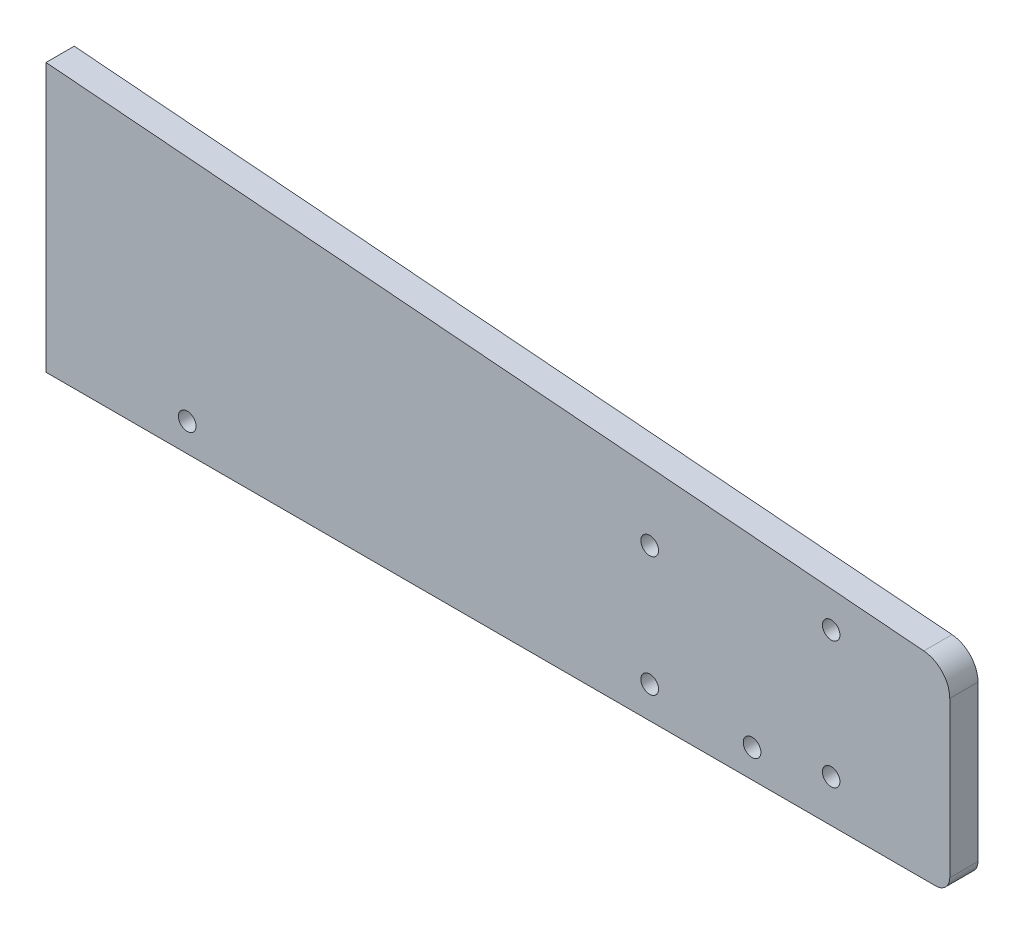
ISO-10303-21;
HEADER;
FILE_DESCRIPTION(('STEP AP214'),'2;1');
FILE_NAME('part.step','',(''),(''),'','','');
FILE_SCHEMA(('AUTOMOTIVE_DESIGN { 1 0 10303 214 1 1 1 1 }'));
ENDSEC;
DATA;
#1=APPLICATION_CONTEXT('core data for automotive mechanical design processes');
#2=APPLICATION_PROTOCOL_DEFINITION('international standard','automotive_design',2000,#1);
#3=PRODUCT_CONTEXT('',#1,'mechanical');
#4=PRODUCT('Part','Part','',(#3));
#5=PRODUCT_RELATED_PRODUCT_CATEGORY('part','',(#4));
#6=PRODUCT_DEFINITION_FORMATION('','',#4);
#7=PRODUCT_DEFINITION_CONTEXT('part definition',#1,'design');
#8=PRODUCT_DEFINITION('design','',#6,#7);
#9=PRODUCT_DEFINITION_SHAPE('','',#8);
#10=(LENGTH_UNIT() NAMED_UNIT(*) SI_UNIT(.MILLI.,.METRE.));
#11=(NAMED_UNIT(*) PLANE_ANGLE_UNIT() SI_UNIT($,.RADIAN.));
#12=(NAMED_UNIT(*) SI_UNIT($,.STERADIAN.) SOLID_ANGLE_UNIT());
#13=UNCERTAINTY_MEASURE_WITH_UNIT(LENGTH_MEASURE(1.E-05),#10,'distance_accuracy_value','');
#14=(GEOMETRIC_REPRESENTATION_CONTEXT(3) GLOBAL_UNCERTAINTY_ASSIGNED_CONTEXT((#13)) GLOBAL_UNIT_ASSIGNED_CONTEXT((#10,
#11,#12)) REPRESENTATION_CONTEXT('',''));
#15=CARTESIAN_POINT('',(0.,0.,0.));
#16=DIRECTION('',(0.,0.,1.));
#17=DIRECTION('',(1.,0.,0.));
#18=AXIS2_PLACEMENT_3D('',#15,#16,#17);
#19=CARTESIAN_POINT('',(469.9,0.,12.7));
#20=DIRECTION('',(0.,1.,0.));
#21=DIRECTION('',(-1.,0.,0.));
#22=AXIS2_PLACEMENT_3D('',#19,#20,#21);
#23=PLANE('',#22);
#24=DIRECTION('',(1.,0.,0.));
#25=VECTOR('',#24,1.);
#26=CARTESIAN_POINT('',(469.9,0.,0.));
#27=LINE('',#26,#25);
#28=CARTESIAN_POINT('',(63.5,0.,0.));
#29=VERTEX_POINT('',#28);
#30=CARTESIAN_POINT('',(463.55,0.,0.));
#31=VERTEX_POINT('',#30);
#32=EDGE_CURVE('E117',#29,#31,#27,.T.);
#33=ORIENTED_EDGE('',*,*,#32,.T.);
#34=DIRECTION('',(0.,0.,-1.));
#35=VECTOR('',#34,1.);
#36=CARTESIAN_POINT('',(463.55,0.,12.7));
#37=LINE('',#36,#35);
#38=CARTESIAN_POINT('',(463.55,0.,12.7));
#39=VERTEX_POINT('',#38);
#40=EDGE_CURVE('E41',#31,#39,#37,.F.);
#41=ORIENTED_EDGE('',*,*,#40,.T.);
#42=DIRECTION('',(1.,0.,0.));
#43=VECTOR('',#42,1.);
#44=CARTESIAN_POINT('',(469.9,0.,12.7));
#45=LINE('',#44,#43);
#46=CARTESIAN_POINT('',(63.5,0.,12.7));
#47=VERTEX_POINT('',#46);
#48=EDGE_CURVE('E95',#47,#39,#45,.T.);
#49=ORIENTED_EDGE('',*,*,#48,.F.);
#50=DIRECTION('',(0.,0.,-1.));
#51=VECTOR('',#50,1.);
#52=CARTESIAN_POINT('',(63.5,0.,12.7));
#53=LINE('',#52,#51);
#54=EDGE_CURVE('E116',#47,#29,#53,.T.);
#55=ORIENTED_EDGE('',*,*,#54,.T.);
#56=EDGE_LOOP('',(#33,#41,#49,#55));
#57=FACE_BOUND('',#56,.T.);
#58=ADVANCED_FACE('F33',(#57),#23,.F.);
#59=CARTESIAN_POINT('',(469.9,76.2,12.7));
#60=DIRECTION('',(-1.,0.,0.));
#61=DIRECTION('',(0.,0.,1.));
#62=AXIS2_PLACEMENT_3D('',#59,#60,#61);
#63=PLANE('',#62);
#64=DIRECTION('',(0.,1.,0.));
#65=VECTOR('',#64,1.);
#66=CARTESIAN_POINT('',(469.9,76.2,12.7));
#67=LINE('',#66,#65);
#68=CARTESIAN_POINT('',(469.9,6.34999999999999,12.7));
#69=VERTEX_POINT('',#68);
#70=CARTESIAN_POINT('',(469.9,76.2,12.7));
#71=VERTEX_POINT('',#70);
#72=EDGE_CURVE('E85',#69,#71,#67,.T.);
#73=ORIENTED_EDGE('',*,*,#72,.F.);
#74=DIRECTION('',(0.,0.,-1.));
#75=VECTOR('',#74,1.);
#76=CARTESIAN_POINT('',(469.9,6.34999999999999,12.7));
#77=LINE('',#76,#75);
#78=CARTESIAN_POINT('',(469.9,6.34999999999999,0.));
#79=VERTEX_POINT('',#78);
#80=EDGE_CURVE('E103',#69,#79,#77,.T.);
#81=ORIENTED_EDGE('',*,*,#80,.T.);
#82=DIRECTION('',(0.,1.,0.));
#83=VECTOR('',#82,1.);
#84=CARTESIAN_POINT('',(469.9,76.2,0.));
#85=LINE('',#84,#83);
#86=CARTESIAN_POINT('',(469.9,76.2,0.));
#87=VERTEX_POINT('',#86);
#88=EDGE_CURVE('E100',#79,#87,#85,.T.);
#89=ORIENTED_EDGE('',*,*,#88,.T.);
#90=DIRECTION('',(0.,0.,-1.));
#91=VECTOR('',#90,1.);
#92=CARTESIAN_POINT('',(469.9,76.2,12.7));
#93=LINE('',#92,#91);
#94=EDGE_CURVE('E98',#71,#87,#93,.T.);
#95=ORIENTED_EDGE('',*,*,#94,.F.);
#96=EDGE_LOOP('',(#73,#81,#89,#95));
#97=FACE_BOUND('',#96,.T.);
#98=ADVANCED_FACE('F99',(#97),#63,.F.);
#99=CARTESIAN_POINT('',(457.2,76.2,12.7));
#100=DIRECTION('',(0.,0.,-1.));
#101=DIRECTION('',(-1.,0.,0.));
#102=AXIS2_PLACEMENT_3D('',#99,#100,#101);
#103=CYLINDRICAL_SURFACE('',#102,12.7);
#104=CARTESIAN_POINT('',(457.2,76.2,0.));
#105=DIRECTION('',(0.,0.,1.));
#106=DIRECTION('',(1.,0.,0.));
#107=AXIS2_PLACEMENT_3D('',#104,#105,#106);
#108=CIRCLE('',#107,12.7);
#109=CARTESIAN_POINT('',(458.21956543178,88.8590081100503,0.));
#110=VERTEX_POINT('',#109);
#111=EDGE_CURVE('E121',#87,#110,#108,.T.);
#112=ORIENTED_EDGE('',*,*,#111,.T.);
#113=DIRECTION('',(0.,0.,-1.));
#114=VECTOR('',#113,1.);
#115=CARTESIAN_POINT('',(458.21956543178,88.8590081100503,12.7));
#116=LINE('',#115,#114);
#117=CARTESIAN_POINT('',(458.21956543178,88.8590081100503,12.7));
#118=VERTEX_POINT('',#117);
#119=EDGE_CURVE('E104',#118,#110,#116,.T.);
#120=ORIENTED_EDGE('',*,*,#119,.F.);
#121=CARTESIAN_POINT('',(457.2,76.2,12.7));
#122=DIRECTION('',(0.,0.,1.));
#123=DIRECTION('',(1.,0.,0.));
#124=AXIS2_PLACEMENT_3D('',#121,#122,#123);
#125=CIRCLE('',#124,12.7);
#126=EDGE_CURVE('E89',#71,#118,#125,.T.);
#127=ORIENTED_EDGE('',*,*,#126,.F.);
#128=ORIENTED_EDGE('',*,*,#94,.T.);
#129=EDGE_LOOP('',(#112,#120,#127,#128));
#130=FACE_BOUND('',#129,.T.);
#131=ADVANCED_FACE('F106',(#130),#103,.T.);
#132=CARTESIAN_POINT('',(63.5,120.65,12.7));
#133=DIRECTION('',(-0.0802807426598325,-0.996772292129946,0.));
#134=DIRECTION('',(0.996772292129946,-0.0802807426598325,0.));
#135=AXIS2_PLACEMENT_3D('',#132,#133,#134);
#136=PLANE('',#135);
#137=DIRECTION('',(-0.996772292129946,0.0802807426598325,0.));
#138=VECTOR('',#137,1.);
#139=CARTESIAN_POINT('',(63.5,120.65,0.));
#140=LINE('',#139,#138);
#141=CARTESIAN_POINT('',(63.5,120.65,0.));
#142=VERTEX_POINT('',#141);
#143=EDGE_CURVE('E123',#110,#142,#140,.T.);
#144=ORIENTED_EDGE('',*,*,#143,.T.);
#145=DIRECTION('',(0.,0.,-1.));
#146=VECTOR('',#145,1.);
#147=CARTESIAN_POINT('',(63.5,120.65,12.7));
#148=LINE('',#147,#146);
#149=CARTESIAN_POINT('',(63.5,120.65,12.7));
#150=VERTEX_POINT('',#149);
#151=EDGE_CURVE('E129',#150,#142,#148,.T.);
#152=ORIENTED_EDGE('',*,*,#151,.F.);
#153=DIRECTION('',(-0.996772292129946,0.0802807426598325,0.));
#154=VECTOR('',#153,1.);
#155=CARTESIAN_POINT('',(63.5,120.65,12.7));
#156=LINE('',#155,#154);
#157=EDGE_CURVE('E109',#118,#150,#156,.T.);
#158=ORIENTED_EDGE('',*,*,#157,.F.);
#159=ORIENTED_EDGE('',*,*,#119,.T.);
#160=EDGE_LOOP('',(#144,#152,#158,#159));
#161=FACE_BOUND('',#160,.T.);
#162=ADVANCED_FACE('F139',(#161),#136,.F.);
#163=CARTESIAN_POINT('',(63.5,0.,12.7));
#164=DIRECTION('',(1.,0.,0.));
#165=DIRECTION('',(0.,0.,-1.));
#166=AXIS2_PLACEMENT_3D('',#163,#164,#165);
#167=PLANE('',#166);
#168=DIRECTION('',(0.,-1.,0.));
#169=VECTOR('',#168,1.);
#170=CARTESIAN_POINT('',(63.5,0.,0.));
#171=LINE('',#170,#169);
#172=EDGE_CURVE('E125',#142,#29,#171,.T.);
#173=ORIENTED_EDGE('',*,*,#172,.T.);
#174=ORIENTED_EDGE('',*,*,#54,.F.);
#175=DIRECTION('',(0.,-1.,0.));
#176=VECTOR('',#175,1.);
#177=CARTESIAN_POINT('',(63.5,0.,12.7));
#178=LINE('',#177,#176);
#179=EDGE_CURVE('E111',#150,#47,#178,.T.);
#180=ORIENTED_EDGE('',*,*,#179,.F.);
#181=ORIENTED_EDGE('',*,*,#151,.T.);
#182=EDGE_LOOP('',(#173,#174,#180,#181));
#183=FACE_BOUND('',#182,.T.);
#184=ADVANCED_FACE('F144',(#183),#167,.F.);
#185=CARTESIAN_POINT('',(457.2,76.2,12.7));
#186=DIRECTION('',(0.,0.,1.));
#187=DIRECTION('',(1.,0.,0.));
#188=AXIS2_PLACEMENT_3D('',#185,#186,#187);
#189=PLANE('',#188);
#190=CARTESIAN_POINT('',(334.9625,14.2874999999999,12.7));
#191=DIRECTION('',(0.,0.,1.));
#192=DIRECTION('',(1.,0.,0.));
#193=AXIS2_PLACEMENT_3D('',#190,#191,#192);
#194=CIRCLE('',#193,3.96874999999997);
#195=CARTESIAN_POINT('',(338.93125,14.2874999999999,12.7));
#196=VERTEX_POINT('',#195);
#197=EDGE_CURVE('E178',#196,#196,#194,.T.);
#198=ORIENTED_EDGE('',*,*,#197,.F.);
#199=EDGE_LOOP('',(#198));
#200=FACE_BOUND('',#199,.T.);
#201=CARTESIAN_POINT('',(334.9625,68.2624999999999,12.7));
#202=DIRECTION('',(0.,0.,1.));
#203=DIRECTION('',(1.,0.,0.));
#204=AXIS2_PLACEMENT_3D('',#201,#202,#203);
#205=CIRCLE('',#204,3.96874999999997);
#206=CARTESIAN_POINT('',(338.93125,68.2624999999999,12.7));
#207=VERTEX_POINT('',#206);
#208=EDGE_CURVE('E172',#207,#207,#205,.T.);
#209=ORIENTED_EDGE('',*,*,#208,.F.);
#210=EDGE_LOOP('',(#209));
#211=FACE_BOUND('',#210,.T.);
#212=CARTESIAN_POINT('',(416.56762,76.2,12.7));
#213=DIRECTION('',(0.,0.,-1.));
#214=DIRECTION('',(-1.,0.,0.));
#215=AXIS2_PLACEMENT_3D('',#212,#213,#214);
#216=CIRCLE('',#215,3.937);
#217=CARTESIAN_POINT('',(412.63062,76.2,12.7));
#218=VERTEX_POINT('',#217);
#219=EDGE_CURVE('E150',#218,#218,#216,.T.);
#220=ORIENTED_EDGE('',*,*,#219,.T.);
#221=EDGE_LOOP('',(#220));
#222=FACE_BOUND('',#221,.T.);
#223=CARTESIAN_POINT('',(416.56762,19.0499999999999,12.7));
#224=DIRECTION('',(0.,0.,-1.));
#225=DIRECTION('',(-1.,0.,0.));
#226=AXIS2_PLACEMENT_3D('',#223,#224,#225);
#227=CIRCLE('',#226,3.937);
#228=CARTESIAN_POINT('',(412.63062,19.0499999999999,12.7));
#229=VERTEX_POINT('',#228);
#230=EDGE_CURVE('E161',#229,#229,#227,.T.);
#231=ORIENTED_EDGE('',*,*,#230,.T.);
#232=EDGE_LOOP('',(#231));
#233=FACE_BOUND('',#232,.T.);
#234=CARTESIAN_POINT('',(127.,12.6999999999999,12.7));
#235=DIRECTION('',(0.,0.,1.));
#236=DIRECTION('',(1.,0.,0.));
#237=AXIS2_PLACEMENT_3D('',#234,#235,#236);
#238=CIRCLE('',#237,3.96874999999999);
#239=CARTESIAN_POINT('',(130.96875,12.6999999999999,12.7));
#240=VERTEX_POINT('',#239);
#241=EDGE_CURVE('E153',#240,#240,#238,.T.);
#242=ORIENTED_EDGE('',*,*,#241,.F.);
#243=EDGE_LOOP('',(#242));
#244=FACE_BOUND('',#243,.T.);
#245=CARTESIAN_POINT('',(381.,12.6999999999999,12.7));
#246=DIRECTION('',(0.,0.,1.));
#247=DIRECTION('',(1.,0.,0.));
#248=AXIS2_PLACEMENT_3D('',#245,#246,#247);
#249=CIRCLE('',#248,3.96875000000005);
#250=CARTESIAN_POINT('',(384.96875,12.6999999999999,12.7));
#251=VERTEX_POINT('',#250);
#252=EDGE_CURVE('E146',#251,#251,#249,.T.);
#253=ORIENTED_EDGE('',*,*,#252,.F.);
#254=EDGE_LOOP('',(#253));
#255=FACE_BOUND('',#254,.T.);
#256=ORIENTED_EDGE('',*,*,#48,.T.);
#257=CARTESIAN_POINT('',(463.55,6.34999999999999,12.7));
#258=DIRECTION('',(0.,0.,1.));
#259=DIRECTION('',(1.,0.,0.));
#260=AXIS2_PLACEMENT_3D('',#257,#258,#259);
#261=CIRCLE('',#260,6.35);
#262=EDGE_CURVE('E11',#39,#69,#261,.T.);
#263=ORIENTED_EDGE('',*,*,#262,.T.);
#264=ORIENTED_EDGE('',*,*,#72,.T.);
#265=ORIENTED_EDGE('',*,*,#126,.T.);
#266=ORIENTED_EDGE('',*,*,#157,.T.);
#267=ORIENTED_EDGE('',*,*,#179,.T.);
#268=EDGE_LOOP('',(#256,#263,#264,#265,#266,#267));
#269=FACE_BOUND('',#268,.T.);
#270=ADVANCED_FACE('F87',(#200,#211,#222,#233,#244,#255,#269),#189,.T.);
#271=CARTESIAN_POINT('',(457.2,76.2,0.));
#272=DIRECTION('',(0.,0.,1.));
#273=DIRECTION('',(1.,0.,0.));
#274=AXIS2_PLACEMENT_3D('',#271,#272,#273);
#275=PLANE('',#274);
#276=CARTESIAN_POINT('',(334.9625,14.2874999999999,0.));
#277=DIRECTION('',(0.,0.,1.));
#278=DIRECTION('',(1.,0.,0.));
#279=AXIS2_PLACEMENT_3D('',#276,#277,#278);
#280=CIRCLE('',#279,3.96875000000002);
#281=CARTESIAN_POINT('',(338.93125,14.2874999999999,0.));
#282=VERTEX_POINT('',#281);
#283=EDGE_CURVE('E175',#282,#282,#280,.T.);
#284=ORIENTED_EDGE('',*,*,#283,.T.);
#285=EDGE_LOOP('',(#284));
#286=FACE_BOUND('',#285,.T.);
#287=CARTESIAN_POINT('',(334.9625,68.2624999999999,0.));
#288=DIRECTION('',(0.,0.,1.));
#289=DIRECTION('',(1.,0.,0.));
#290=AXIS2_PLACEMENT_3D('',#287,#288,#289);
#291=CIRCLE('',#290,3.96875000000002);
#292=CARTESIAN_POINT('',(338.93125,68.2624999999999,0.));
#293=VERTEX_POINT('',#292);
#294=EDGE_CURVE('E162',#293,#293,#291,.T.);
#295=ORIENTED_EDGE('',*,*,#294,.T.);
#296=EDGE_LOOP('',(#295));
#297=FACE_BOUND('',#296,.T.);
#298=CARTESIAN_POINT('',(416.56762,76.2,0.));
#299=DIRECTION('',(0.,0.,-1.));
#300=DIRECTION('',(-1.,0.,0.));
#301=AXIS2_PLACEMENT_3D('',#298,#299,#300);
#302=CIRCLE('',#301,3.937);
#303=CARTESIAN_POINT('',(412.63062,76.2,0.));
#304=VERTEX_POINT('',#303);
#305=EDGE_CURVE('E165',#304,#304,#302,.T.);
#306=ORIENTED_EDGE('',*,*,#305,.F.);
#307=EDGE_LOOP('',(#306));
#308=FACE_BOUND('',#307,.T.);
#309=CARTESIAN_POINT('',(416.56762,19.0499999999999,0.));
#310=DIRECTION('',(0.,0.,-1.));
#311=DIRECTION('',(-1.,0.,0.));
#312=AXIS2_PLACEMENT_3D('',#309,#310,#311);
#313=CIRCLE('',#312,3.937);
#314=CARTESIAN_POINT('',(412.63062,19.0499999999999,0.));
#315=VERTEX_POINT('',#314);
#316=EDGE_CURVE('E158',#315,#315,#313,.T.);
#317=ORIENTED_EDGE('',*,*,#316,.F.);
#318=EDGE_LOOP('',(#317));
#319=FACE_BOUND('',#318,.T.);
#320=CARTESIAN_POINT('',(127.,12.6999999999999,0.));
#321=DIRECTION('',(0.,0.,1.));
#322=DIRECTION('',(1.,0.,0.));
#323=AXIS2_PLACEMENT_3D('',#320,#321,#322);
#324=CIRCLE('',#323,3.96874999999999);
#325=CARTESIAN_POINT('',(130.96875,12.6999999999999,0.));
#326=VERTEX_POINT('',#325);
#327=EDGE_CURVE('E119',#326,#326,#324,.T.);
#328=ORIENTED_EDGE('',*,*,#327,.T.);
#329=EDGE_LOOP('',(#328));
#330=FACE_BOUND('',#329,.T.);
#331=CARTESIAN_POINT('',(381.,12.6999999999999,0.));
#332=DIRECTION('',(0.,0.,1.));
#333=DIRECTION('',(1.,0.,0.));
#334=AXIS2_PLACEMENT_3D('',#331,#332,#333);
#335=CIRCLE('',#334,3.96875000000005);
#336=CARTESIAN_POINT('',(384.96875,12.6999999999999,0.));
#337=VERTEX_POINT('',#336);
#338=EDGE_CURVE('E149',#337,#337,#335,.T.);
#339=ORIENTED_EDGE('',*,*,#338,.T.);
#340=EDGE_LOOP('',(#339));
#341=FACE_BOUND('',#340,.T.);
#342=ORIENTED_EDGE('',*,*,#88,.F.);
#343=CARTESIAN_POINT('',(463.55,6.34999999999999,0.));
#344=DIRECTION('',(0.,0.,1.));
#345=DIRECTION('',(1.,0.,0.));
#346=AXIS2_PLACEMENT_3D('',#343,#344,#345);
#347=CIRCLE('',#346,6.35);
#348=EDGE_CURVE('E55',#79,#31,#347,.F.);
#349=ORIENTED_EDGE('',*,*,#348,.T.);
#350=ORIENTED_EDGE('',*,*,#32,.F.);
#351=ORIENTED_EDGE('',*,*,#172,.F.);
#352=ORIENTED_EDGE('',*,*,#143,.F.);
#353=ORIENTED_EDGE('',*,*,#111,.F.);
#354=EDGE_LOOP('',(#342,#349,#350,#351,#352,#353));
#355=FACE_BOUND('',#354,.T.);
#356=ADVANCED_FACE('F135',(#286,#297,#308,#319,#330,#341,#355),#275,.F.);
#357=CARTESIAN_POINT('',(381.,12.6999999999999,0.));
#358=DIRECTION('',(0.,0.,1.));
#359=DIRECTION('',(1.,0.,0.));
#360=AXIS2_PLACEMENT_3D('',#357,#358,#359);
#361=CYLINDRICAL_SURFACE('',#360,3.96875000000005);
#362=ORIENTED_EDGE('',*,*,#338,.F.);
#363=EDGE_LOOP('',(#362));
#364=FACE_BOUND('',#363,.T.);
#365=ORIENTED_EDGE('',*,*,#252,.T.);
#366=EDGE_LOOP('',(#365));
#367=FACE_BOUND('',#366,.T.);
#368=ADVANCED_FACE('F197',(#364,#367),#361,.F.);
#369=CARTESIAN_POINT('',(127.,12.6999999999999,0.));
#370=DIRECTION('',(0.,0.,1.));
#371=DIRECTION('',(1.,0.,0.));
#372=AXIS2_PLACEMENT_3D('',#369,#370,#371);
#373=CYLINDRICAL_SURFACE('',#372,3.96874999999999);
#374=ORIENTED_EDGE('',*,*,#327,.F.);
#375=EDGE_LOOP('',(#374));
#376=FACE_BOUND('',#375,.T.);
#377=ORIENTED_EDGE('',*,*,#241,.T.);
#378=EDGE_LOOP('',(#377));
#379=FACE_BOUND('',#378,.T.);
#380=ADVANCED_FACE('F199',(#376,#379),#373,.F.);
#381=CARTESIAN_POINT('',(463.55,6.34999999999999,12.7));
#382=DIRECTION('',(0.,0.,-1.));
#383=DIRECTION('',(-1.,0.,0.));
#384=AXIS2_PLACEMENT_3D('',#381,#382,#383);
#385=CYLINDRICAL_SURFACE('',#384,6.35);
#386=ORIENTED_EDGE('',*,*,#262,.F.);
#387=ORIENTED_EDGE('',*,*,#40,.F.);
#388=ORIENTED_EDGE('',*,*,#348,.F.);
#389=ORIENTED_EDGE('',*,*,#80,.F.);
#390=EDGE_LOOP('',(#386,#387,#388,#389));
#391=FACE_BOUND('',#390,.T.);
#392=ADVANCED_FACE('F35',(#391),#385,.T.);
#393=CARTESIAN_POINT('',(416.56762,19.0499999999999,12.7));
#394=DIRECTION('',(0.,0.,-1.));
#395=DIRECTION('',(-1.,0.,0.));
#396=AXIS2_PLACEMENT_3D('',#393,#394,#395);
#397=CYLINDRICAL_SURFACE('',#396,3.937);
#398=ORIENTED_EDGE('',*,*,#230,.F.);
#399=EDGE_LOOP('',(#398));
#400=FACE_BOUND('',#399,.T.);
#401=ORIENTED_EDGE('',*,*,#316,.T.);
#402=EDGE_LOOP('',(#401));
#403=FACE_BOUND('',#402,.T.);
#404=ADVANCED_FACE('F267',(#400,#403),#397,.F.);
#405=CARTESIAN_POINT('',(416.56762,76.2,12.7));
#406=DIRECTION('',(0.,0.,-1.));
#407=DIRECTION('',(-1.,0.,0.));
#408=AXIS2_PLACEMENT_3D('',#405,#406,#407);
#409=CYLINDRICAL_SURFACE('',#408,3.937);
#410=ORIENTED_EDGE('',*,*,#219,.F.);
#411=EDGE_LOOP('',(#410));
#412=FACE_BOUND('',#411,.T.);
#413=ORIENTED_EDGE('',*,*,#305,.T.);
#414=EDGE_LOOP('',(#413));
#415=FACE_BOUND('',#414,.T.);
#416=ADVANCED_FACE('F248',(#412,#415),#409,.F.);
#417=CARTESIAN_POINT('',(334.9625,68.2624999999999,12.7));
#418=DIRECTION('',(0.,0.,1.));
#419=DIRECTION('',(1.,0.,0.));
#420=AXIS2_PLACEMENT_3D('',#417,#418,#419);
#421=CYLINDRICAL_SURFACE('',#420,3.96874999999999);
#422=ORIENTED_EDGE('',*,*,#294,.F.);
#423=EDGE_LOOP('',(#422));
#424=FACE_BOUND('',#423,.T.);
#425=ORIENTED_EDGE('',*,*,#208,.T.);
#426=EDGE_LOOP('',(#425));
#427=FACE_BOUND('',#426,.T.);
#428=ADVANCED_FACE('F243',(#424,#427),#421,.F.);
#429=CARTESIAN_POINT('',(334.9625,14.2874999999999,12.7));
#430=DIRECTION('',(0.,0.,1.));
#431=DIRECTION('',(1.,0.,0.));
#432=AXIS2_PLACEMENT_3D('',#429,#430,#431);
#433=CYLINDRICAL_SURFACE('',#432,3.96874999999999);
#434=ORIENTED_EDGE('',*,*,#283,.F.);
#435=EDGE_LOOP('',(#434));
#436=FACE_BOUND('',#435,.T.);
#437=ORIENTED_EDGE('',*,*,#197,.T.);
#438=EDGE_LOOP('',(#437));
#439=FACE_BOUND('',#438,.T.);
#440=ADVANCED_FACE('F182',(#436,#439),#433,.F.);
#441=CLOSED_SHELL('',(#58,#98,#131,#162,#184,#270,#356,#368,#380,#392,#404,#416,#428,#440));
#442=MANIFOLD_SOLID_BREP('B2',#441);
#443=ADVANCED_BREP_SHAPE_REPRESENTATION('',(#18,#442),#14);
#444=SHAPE_DEFINITION_REPRESENTATION(#9,#443);
ENDSEC;
END-ISO-10303-21;
